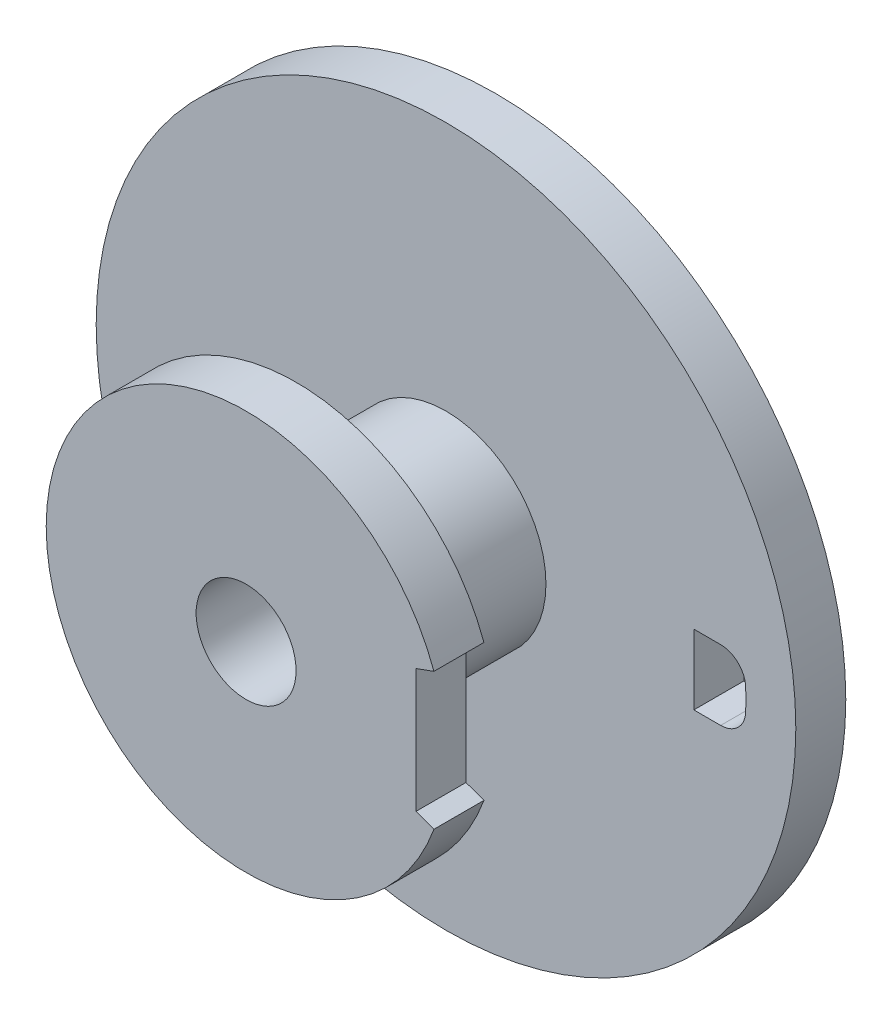
ISO-10303-21;
HEADER;
FILE_DESCRIPTION(('STEP AP214'),'2;1');
FILE_NAME('part.step','',(''),(''),'','','');
FILE_SCHEMA(('AUTOMOTIVE_DESIGN { 1 0 10303 214 1 1 1 1 }'));
ENDSEC;
DATA;
#1=APPLICATION_CONTEXT('core data for automotive mechanical design processes');
#2=APPLICATION_PROTOCOL_DEFINITION('international standard','automotive_design',2000,#1);
#3=PRODUCT_CONTEXT('',#1,'mechanical');
#4=PRODUCT('Part','Part','',(#3));
#5=PRODUCT_RELATED_PRODUCT_CATEGORY('part','',(#4));
#6=PRODUCT_DEFINITION_FORMATION('','',#4);
#7=PRODUCT_DEFINITION_CONTEXT('part definition',#1,'design');
#8=PRODUCT_DEFINITION('design','',#6,#7);
#9=PRODUCT_DEFINITION_SHAPE('','',#8);
#10=(LENGTH_UNIT() NAMED_UNIT(*) SI_UNIT(.MILLI.,.METRE.));
#11=(NAMED_UNIT(*) PLANE_ANGLE_UNIT() SI_UNIT($,.RADIAN.));
#12=(NAMED_UNIT(*) SI_UNIT($,.STERADIAN.) SOLID_ANGLE_UNIT());
#13=UNCERTAINTY_MEASURE_WITH_UNIT(LENGTH_MEASURE(1.E-05),#10,'distance_accuracy_value','');
#14=(GEOMETRIC_REPRESENTATION_CONTEXT(3) GLOBAL_UNCERTAINTY_ASSIGNED_CONTEXT((#13)) GLOBAL_UNIT_ASSIGNED_CONTEXT((#10,
#11,#12)) REPRESENTATION_CONTEXT('',''));
#15=CARTESIAN_POINT('',(0.,0.,0.));
#16=DIRECTION('',(0.,0.,1.));
#17=DIRECTION('',(1.,0.,0.));
#18=AXIS2_PLACEMENT_3D('',#15,#16,#17);
#19=CARTESIAN_POINT('',(0.,0.,-0.75));
#20=DIRECTION('',(0.,0.,1.));
#21=DIRECTION('',(1.,0.,0.));
#22=AXIS2_PLACEMENT_3D('',#19,#20,#21);
#23=CYLINDRICAL_SURFACE('',#22,0.5);
#24=CARTESIAN_POINT('',(0.,0.,-0.75));
#25=DIRECTION('',(0.,0.,-1.));
#26=DIRECTION('',(-1.,0.,0.));
#27=AXIS2_PLACEMENT_3D('',#24,#25,#26);
#28=CIRCLE('',#27,0.5);
#29=CARTESIAN_POINT('',(-0.5,0.,-0.75));
#30=VERTEX_POINT('',#29);
#31=EDGE_CURVE('E170',#30,#30,#28,.F.);
#32=ORIENTED_EDGE('',*,*,#31,.T.);
#33=EDGE_LOOP('',(#32));
#34=FACE_BOUND('',#33,.T.);
#35=CARTESIAN_POINT('',(0.,0.,0.));
#36=DIRECTION('',(0.,0.,1.));
#37=DIRECTION('',(1.,0.,0.));
#38=AXIS2_PLACEMENT_3D('',#35,#36,#37);
#39=CIRCLE('',#38,0.5);
#40=CARTESIAN_POINT('',(0.5,0.,0.));
#41=VERTEX_POINT('',#40);
#42=EDGE_CURVE('E11',#41,#41,#39,.T.);
#43=ORIENTED_EDGE('',*,*,#42,.F.);
#44=EDGE_LOOP('',(#43));
#45=FACE_BOUND('',#44,.T.);
#46=ADVANCED_FACE('F39',(#34,#45),#23,.T.);
#47=CARTESIAN_POINT('',(0.,0.,-0.75));
#48=DIRECTION('',(0.,0.,1.));
#49=DIRECTION('',(1.,0.,0.));
#50=AXIS2_PLACEMENT_3D('',#47,#48,#49);
#51=CYLINDRICAL_SURFACE('',#50,0.25);
#52=CARTESIAN_POINT('',(0.,0.,0.25));
#53=DIRECTION('',(0.,0.,1.));
#54=DIRECTION('',(1.,0.,0.));
#55=AXIS2_PLACEMENT_3D('',#52,#53,#54);
#56=CIRCLE('',#55,0.25);
#57=CARTESIAN_POINT('',(0.25,0.,0.25));
#58=VERTEX_POINT('',#57);
#59=EDGE_CURVE('E175',#58,#58,#56,.T.);
#60=ORIENTED_EDGE('',*,*,#59,.T.);
#61=EDGE_LOOP('',(#60));
#62=FACE_BOUND('',#61,.T.);
#63=CARTESIAN_POINT('',(0.,0.,-1.));
#64=DIRECTION('',(0.,0.,-1.));
#65=DIRECTION('',(-1.,0.,0.));
#66=AXIS2_PLACEMENT_3D('',#63,#64,#65);
#67=CIRCLE('',#66,0.25);
#68=CARTESIAN_POINT('',(-0.25,0.,-1.));
#69=VERTEX_POINT('',#68);
#70=EDGE_CURVE('E129',#69,#69,#67,.T.);
#71=ORIENTED_EDGE('',*,*,#70,.T.);
#72=EDGE_LOOP('',(#71));
#73=FACE_BOUND('',#72,.T.);
#74=ADVANCED_FACE('F238',(#62,#73),#51,.F.);
#75=CARTESIAN_POINT('',(0.,0.,0.25));
#76=DIRECTION('',(0.,0.,1.));
#77=DIRECTION('',(1.,0.,0.));
#78=AXIS2_PLACEMENT_3D('',#75,#76,#77);
#79=PLANE('',#78);
#80=CARTESIAN_POINT('',(0.,0.,0.25));
#81=DIRECTION('',(0.,0.,1.));
#82=DIRECTION('',(1.,0.,0.));
#83=AXIS2_PLACEMENT_3D('',#80,#81,#82);
#84=CIRCLE('',#83,1.);
#85=CARTESIAN_POINT('',(0.939692620785908,0.342020143325669,0.25));
#86=VERTEX_POINT('',#85);
#87=CARTESIAN_POINT('',(0.939692620785908,-0.342020143325669,0.25));
#88=VERTEX_POINT('',#87);
#89=EDGE_CURVE('E179',#86,#88,#84,.T.);
#90=ORIENTED_EDGE('',*,*,#89,.T.);
#91=DIRECTION('',(-0.939692620785908,0.34202014332567,0.));
#92=VECTOR('',#91,1.);
#93=CARTESIAN_POINT('',(0.85,-0.309374699126273,0.25));
#94=LINE('',#93,#92);
#95=CARTESIAN_POINT('',(0.85,-0.309374699126273,0.25));
#96=VERTEX_POINT('',#95);
#97=EDGE_CURVE('E181',#88,#96,#94,.T.);
#98=ORIENTED_EDGE('',*,*,#97,.T.);
#99=DIRECTION('',(0.,1.,0.));
#100=VECTOR('',#99,1.);
#101=CARTESIAN_POINT('',(0.85,0.309374699126273,0.25));
#102=LINE('',#101,#100);
#103=CARTESIAN_POINT('',(0.85,0.309374699126273,0.25));
#104=VERTEX_POINT('',#103);
#105=EDGE_CURVE('E184',#96,#104,#102,.T.);
#106=ORIENTED_EDGE('',*,*,#105,.T.);
#107=DIRECTION('',(0.939692620785908,0.342020143325669,0.));
#108=VECTOR('',#107,1.);
#109=CARTESIAN_POINT('',(0.85,0.309374699126273,0.25));
#110=LINE('',#109,#108);
#111=EDGE_CURVE('E186',#104,#86,#110,.T.);
#112=ORIENTED_EDGE('',*,*,#111,.T.);
#113=EDGE_LOOP('',(#90,#98,#106,#112));
#114=FACE_BOUND('',#113,.T.);
#115=ORIENTED_EDGE('',*,*,#59,.F.);
#116=EDGE_LOOP('',(#115));
#117=FACE_BOUND('',#116,.T.);
#118=ADVANCED_FACE('F225',(#114,#117),#79,.T.);
#119=CARTESIAN_POINT('',(0.,0.,0.));
#120=DIRECTION('',(0.,0.,1.));
#121=DIRECTION('',(1.,0.,0.));
#122=AXIS2_PLACEMENT_3D('',#119,#120,#121);
#123=PLANE('',#122);
#124=ORIENTED_EDGE('',*,*,#42,.T.);
#125=EDGE_LOOP('',(#124));
#126=FACE_BOUND('',#125,.T.);
#127=CARTESIAN_POINT('',(0.,0.,0.));
#128=DIRECTION('',(0.,0.,1.));
#129=DIRECTION('',(1.,0.,0.));
#130=AXIS2_PLACEMENT_3D('',#127,#128,#129);
#131=CIRCLE('',#130,1.);
#132=CARTESIAN_POINT('',(0.939692620785908,0.342020143325669,0.));
#133=VERTEX_POINT('',#132);
#134=CARTESIAN_POINT('',(0.939692620785908,-0.342020143325669,0.));
#135=VERTEX_POINT('',#134);
#136=EDGE_CURVE('E178',#133,#135,#131,.T.);
#137=ORIENTED_EDGE('',*,*,#136,.F.);
#138=DIRECTION('',(0.939692620785908,0.342020143325669,0.));
#139=VECTOR('',#138,1.);
#140=CARTESIAN_POINT('',(0.85,0.309374699126273,0.));
#141=LINE('',#140,#139);
#142=CARTESIAN_POINT('',(0.85,0.309374699126273,0.));
#143=VERTEX_POINT('',#142);
#144=EDGE_CURVE('E182',#143,#133,#141,.T.);
#145=ORIENTED_EDGE('',*,*,#144,.F.);
#146=DIRECTION('',(0.,1.,0.));
#147=VECTOR('',#146,1.);
#148=CARTESIAN_POINT('',(0.85,0.309374699126273,0.));
#149=LINE('',#148,#147);
#150=CARTESIAN_POINT('',(0.85,-0.309374699126273,0.));
#151=VERTEX_POINT('',#150);
#152=EDGE_CURVE('E192',#151,#143,#149,.T.);
#153=ORIENTED_EDGE('',*,*,#152,.F.);
#154=DIRECTION('',(-0.939692620785908,0.34202014332567,0.));
#155=VECTOR('',#154,1.);
#156=CARTESIAN_POINT('',(0.85,-0.309374699126273,0.));
#157=LINE('',#156,#155);
#158=EDGE_CURVE('E190',#135,#151,#157,.T.);
#159=ORIENTED_EDGE('',*,*,#158,.F.);
#160=EDGE_LOOP('',(#137,#145,#153,#159));
#161=FACE_BOUND('',#160,.T.);
#162=ADVANCED_FACE('F214',(#126,#161),#123,.F.);
#163=CARTESIAN_POINT('',(0.,0.,0.25));
#164=DIRECTION('',(0.,0.,-1.));
#165=DIRECTION('',(-1.,0.,0.));
#166=AXIS2_PLACEMENT_3D('',#163,#164,#165);
#167=CYLINDRICAL_SURFACE('',#166,1.);
#168=ORIENTED_EDGE('',*,*,#136,.T.);
#169=DIRECTION('',(0.,0.,-1.));
#170=VECTOR('',#169,1.);
#171=CARTESIAN_POINT('',(0.939692620785908,-0.342020143325669,0.25));
#172=LINE('',#171,#170);
#173=EDGE_CURVE('E46',#88,#135,#172,.T.);
#174=ORIENTED_EDGE('',*,*,#173,.F.);
#175=ORIENTED_EDGE('',*,*,#89,.F.);
#176=DIRECTION('',(0.,0.,-1.));
#177=VECTOR('',#176,1.);
#178=CARTESIAN_POINT('',(0.939692620785908,0.342020143325669,0.25));
#179=LINE('',#178,#177);
#180=EDGE_CURVE('E188',#86,#133,#179,.T.);
#181=ORIENTED_EDGE('',*,*,#180,.T.);
#182=EDGE_LOOP('',(#168,#174,#175,#181));
#183=FACE_BOUND('',#182,.T.);
#184=ADVANCED_FACE('F227',(#183),#167,.T.);
#185=CARTESIAN_POINT('',(0.85,-0.309374699126273,0.25));
#186=DIRECTION('',(-0.34202014332567,-0.939692620785908,0.));
#187=DIRECTION('',(0.939692620785908,-0.34202014332567,0.));
#188=AXIS2_PLACEMENT_3D('',#185,#186,#187);
#189=PLANE('',#188);
#190=ORIENTED_EDGE('',*,*,#158,.T.);
#191=DIRECTION('',(0.,0.,-1.));
#192=VECTOR('',#191,1.);
#193=CARTESIAN_POINT('',(0.85,-0.309374699126273,0.25));
#194=LINE('',#193,#192);
#195=EDGE_CURVE('E201',#96,#151,#194,.T.);
#196=ORIENTED_EDGE('',*,*,#195,.F.);
#197=ORIENTED_EDGE('',*,*,#97,.F.);
#198=ORIENTED_EDGE('',*,*,#173,.T.);
#199=EDGE_LOOP('',(#190,#196,#197,#198));
#200=FACE_BOUND('',#199,.T.);
#201=ADVANCED_FACE('F208',(#200),#189,.F.);
#202=CARTESIAN_POINT('',(0.85,0.309374699126273,0.25));
#203=DIRECTION('',(-1.,0.,0.));
#204=DIRECTION('',(0.,-1.,0.));
#205=AXIS2_PLACEMENT_3D('',#202,#203,#204);
#206=PLANE('',#205);
#207=ORIENTED_EDGE('',*,*,#152,.T.);
#208=DIRECTION('',(0.,0.,-1.));
#209=VECTOR('',#208,1.);
#210=CARTESIAN_POINT('',(0.85,0.309374699126273,0.25));
#211=LINE('',#210,#209);
#212=EDGE_CURVE('E198',#104,#143,#211,.T.);
#213=ORIENTED_EDGE('',*,*,#212,.F.);
#214=ORIENTED_EDGE('',*,*,#105,.F.);
#215=ORIENTED_EDGE('',*,*,#195,.T.);
#216=EDGE_LOOP('',(#207,#213,#214,#215));
#217=FACE_BOUND('',#216,.T.);
#218=ADVANCED_FACE('F218',(#217),#206,.F.);
#219=CARTESIAN_POINT('',(0.85,0.309374699126273,0.25));
#220=DIRECTION('',(-0.342020143325669,0.939692620785908,0.));
#221=DIRECTION('',(-0.939692620785908,-0.342020143325669,0.));
#222=AXIS2_PLACEMENT_3D('',#219,#220,#221);
#223=PLANE('',#222);
#224=ORIENTED_EDGE('',*,*,#144,.T.);
#225=ORIENTED_EDGE('',*,*,#180,.F.);
#226=ORIENTED_EDGE('',*,*,#111,.F.);
#227=ORIENTED_EDGE('',*,*,#212,.T.);
#228=EDGE_LOOP('',(#224,#225,#226,#227));
#229=FACE_BOUND('',#228,.T.);
#230=ADVANCED_FACE('F222',(#229),#223,.F.);
#231=CARTESIAN_POINT('',(0.,0.,-1.));
#232=DIRECTION('',(0.,0.,-1.));
#233=DIRECTION('',(-1.,0.,0.));
#234=AXIS2_PLACEMENT_3D('',#231,#232,#233);
#235=PLANE('',#234);
#236=DIRECTION('',(0.,1.,0.));
#237=VECTOR('',#236,1.);
#238=CARTESIAN_POINT('',(1.23975669154396,0.175,-1.));
#239=LINE('',#238,#237);
#240=CARTESIAN_POINT('',(1.23975669154396,-0.175,-1.));
#241=VERTEX_POINT('',#240);
#242=CARTESIAN_POINT('',(1.23975669154396,0.175,-1.));
#243=VERTEX_POINT('',#242);
#244=EDGE_CURVE('E53',#241,#243,#239,.T.);
#245=ORIENTED_EDGE('',*,*,#244,.F.);
#246=DIRECTION('',(-1.,0.,0.));
#247=VECTOR('',#246,1.);
#248=CARTESIAN_POINT('',(1.23975669154396,-0.175,-1.));
#249=LINE('',#248,#247);
#250=CARTESIAN_POINT('',(1.37409060836613,-0.175,-1.));
#251=VERTEX_POINT('',#250);
#252=EDGE_CURVE('E123',#251,#241,#249,.T.);
#253=ORIENTED_EDGE('',*,*,#252,.F.);
#254=CARTESIAN_POINT('',(1.37409060836613,-0.05,-1.));
#255=DIRECTION('',(0.,0.,-1.));
#256=DIRECTION('',(1.,0.,0.));
#257=AXIS2_PLACEMENT_3D('',#254,#255,#256);
#258=CIRCLE('',#257,0.125);
#259=CARTESIAN_POINT('',(1.49900793639941,-0.0545454545454545,-1.));
#260=VERTEX_POINT('',#259);
#261=EDGE_CURVE('E151',#260,#251,#258,.T.);
#262=ORIENTED_EDGE('',*,*,#261,.F.);
#263=CARTESIAN_POINT('',(0.,0.,-1.));
#264=DIRECTION('',(0.,0.,-1.));
#265=DIRECTION('',(-1.,0.,0.));
#266=AXIS2_PLACEMENT_3D('',#263,#264,#265);
#267=CIRCLE('',#266,1.5);
#268=CARTESIAN_POINT('',(1.49900793639941,0.0545454545454546,-1.));
#269=VERTEX_POINT('',#268);
#270=EDGE_CURVE('E148',#269,#260,#267,.T.);
#271=ORIENTED_EDGE('',*,*,#270,.F.);
#272=CARTESIAN_POINT('',(1.37409060836613,0.05,-1.));
#273=DIRECTION('',(0.,0.,-1.));
#274=DIRECTION('',(-1.,0.,0.));
#275=AXIS2_PLACEMENT_3D('',#272,#273,#274);
#276=CIRCLE('',#275,0.125);
#277=CARTESIAN_POINT('',(1.37409060836613,0.175,-1.));
#278=VERTEX_POINT('',#277);
#279=EDGE_CURVE('E145',#278,#269,#276,.T.);
#280=ORIENTED_EDGE('',*,*,#279,.F.);
#281=DIRECTION('',(1.,0.,0.));
#282=VECTOR('',#281,1.);
#283=CARTESIAN_POINT('',(1.37409060836613,0.175,-1.));
#284=LINE('',#283,#282);
#285=EDGE_CURVE('E138',#243,#278,#284,.T.);
#286=ORIENTED_EDGE('',*,*,#285,.F.);
#287=EDGE_LOOP('',(#245,#253,#262,#271,#280,#286));
#288=FACE_BOUND('',#287,.T.);
#289=CARTESIAN_POINT('',(0.,0.,-1.));
#290=DIRECTION('',(0.,0.,-1.));
#291=DIRECTION('',(-1.,0.,0.));
#292=AXIS2_PLACEMENT_3D('',#289,#290,#291);
#293=CIRCLE('',#292,1.75);
#294=CARTESIAN_POINT('',(-1.75,0.,-1.));
#295=VERTEX_POINT('',#294);
#296=EDGE_CURVE('E167',#295,#295,#293,.T.);
#297=ORIENTED_EDGE('',*,*,#296,.T.);
#298=EDGE_LOOP('',(#297));
#299=FACE_BOUND('',#298,.T.);
#300=ORIENTED_EDGE('',*,*,#70,.F.);
#301=EDGE_LOOP('',(#300));
#302=FACE_BOUND('',#301,.T.);
#303=ADVANCED_FACE('F250',(#288,#299,#302),#235,.T.);
#304=CARTESIAN_POINT('',(0.,0.,-0.75));
#305=DIRECTION('',(0.,0.,-1.));
#306=DIRECTION('',(-1.,0.,0.));
#307=AXIS2_PLACEMENT_3D('',#304,#305,#306);
#308=PLANE('',#307);
#309=DIRECTION('',(1.,0.,0.));
#310=VECTOR('',#309,1.);
#311=CARTESIAN_POINT('',(1.23975669154396,-0.175,-0.75));
#312=LINE('',#311,#310);
#313=CARTESIAN_POINT('',(1.23975669154396,-0.175,-0.75));
#314=VERTEX_POINT('',#313);
#315=CARTESIAN_POINT('',(1.37409060836613,-0.175,-0.75));
#316=VERTEX_POINT('',#315);
#317=EDGE_CURVE('E136',#314,#316,#312,.T.);
#318=ORIENTED_EDGE('',*,*,#317,.F.);
#319=DIRECTION('',(0.,-1.,0.));
#320=VECTOR('',#319,1.);
#321=CARTESIAN_POINT('',(1.23975669154396,0.175,-0.75));
#322=LINE('',#321,#320);
#323=CARTESIAN_POINT('',(1.23975669154396,0.175,-0.75));
#324=VERTEX_POINT('',#323);
#325=EDGE_CURVE('E117',#324,#314,#322,.T.);
#326=ORIENTED_EDGE('',*,*,#325,.F.);
#327=DIRECTION('',(-1.,0.,0.));
#328=VECTOR('',#327,1.);
#329=CARTESIAN_POINT('',(1.37409060836613,0.175,-0.75));
#330=LINE('',#329,#328);
#331=CARTESIAN_POINT('',(1.37409060836613,0.175,-0.75));
#332=VERTEX_POINT('',#331);
#333=EDGE_CURVE('E126',#332,#324,#330,.T.);
#334=ORIENTED_EDGE('',*,*,#333,.F.);
#335=CARTESIAN_POINT('',(1.37409060836613,0.05,-0.75));
#336=DIRECTION('',(0.,0.,-1.));
#337=DIRECTION('',(-1.,0.,0.));
#338=AXIS2_PLACEMENT_3D('',#335,#336,#337);
#339=CIRCLE('',#338,0.125);
#340=CARTESIAN_POINT('',(1.49900793639941,0.0545454545454546,-0.75));
#341=VERTEX_POINT('',#340);
#342=EDGE_CURVE('E61',#341,#332,#339,.F.);
#343=ORIENTED_EDGE('',*,*,#342,.F.);
#344=CARTESIAN_POINT('',(0.,0.,-0.75));
#345=DIRECTION('',(0.,0.,-1.));
#346=DIRECTION('',(-1.,0.,0.));
#347=AXIS2_PLACEMENT_3D('',#344,#345,#346);
#348=CIRCLE('',#347,1.5);
#349=CARTESIAN_POINT('',(1.49900793639941,-0.0545454545454545,-0.75));
#350=VERTEX_POINT('',#349);
#351=EDGE_CURVE('E411',#350,#341,#348,.F.);
#352=ORIENTED_EDGE('',*,*,#351,.F.);
#353=CARTESIAN_POINT('',(1.37409060836613,-0.05,-0.75));
#354=DIRECTION('',(0.,0.,-1.));
#355=DIRECTION('',(-1.,0.,0.));
#356=AXIS2_PLACEMENT_3D('',#353,#354,#355);
#357=CIRCLE('',#356,0.125);
#358=EDGE_CURVE('E140',#316,#350,#357,.F.);
#359=ORIENTED_EDGE('',*,*,#358,.F.);
#360=EDGE_LOOP('',(#318,#326,#334,#343,#352,#359));
#361=FACE_BOUND('',#360,.T.);
#362=ORIENTED_EDGE('',*,*,#31,.F.);
#363=EDGE_LOOP('',(#362));
#364=FACE_BOUND('',#363,.T.);
#365=CARTESIAN_POINT('',(0.,0.,-0.75));
#366=DIRECTION('',(0.,0.,-1.));
#367=DIRECTION('',(-1.,0.,0.));
#368=AXIS2_PLACEMENT_3D('',#365,#366,#367);
#369=CIRCLE('',#368,1.75);
#370=CARTESIAN_POINT('',(-1.75,0.,-0.75));
#371=VERTEX_POINT('',#370);
#372=EDGE_CURVE('E166',#371,#371,#369,.T.);
#373=ORIENTED_EDGE('',*,*,#372,.F.);
#374=EDGE_LOOP('',(#373));
#375=FACE_BOUND('',#374,.T.);
#376=ADVANCED_FACE('F132',(#361,#364,#375),#308,.F.);
#377=CARTESIAN_POINT('',(0.,0.,-1.));
#378=DIRECTION('',(0.,0.,1.));
#379=DIRECTION('',(1.,0.,0.));
#380=AXIS2_PLACEMENT_3D('',#377,#378,#379);
#381=CYLINDRICAL_SURFACE('',#380,1.75);
#382=ORIENTED_EDGE('',*,*,#296,.F.);
#383=EDGE_LOOP('',(#382));
#384=FACE_BOUND('',#383,.T.);
#385=ORIENTED_EDGE('',*,*,#372,.T.);
#386=EDGE_LOOP('',(#385));
#387=FACE_BOUND('',#386,.T.);
#388=ADVANCED_FACE('F249',(#384,#387),#381,.T.);
#389=CARTESIAN_POINT('',(1.23975669154396,0.175,0.251));
#390=DIRECTION('',(-1.,0.,0.));
#391=DIRECTION('',(0.,-1.,0.));
#392=AXIS2_PLACEMENT_3D('',#389,#390,#391);
#393=PLANE('',#392);
#394=ORIENTED_EDGE('',*,*,#325,.T.);
#395=DIRECTION('',(0.,0.,-1.));
#396=VECTOR('',#395,1.);
#397=CARTESIAN_POINT('',(1.23975669154396,-0.175,0.251));
#398=LINE('',#397,#396);
#399=EDGE_CURVE('E130',#314,#241,#398,.T.);
#400=ORIENTED_EDGE('',*,*,#399,.T.);
#401=ORIENTED_EDGE('',*,*,#244,.T.);
#402=DIRECTION('',(0.,0.,-1.));
#403=VECTOR('',#402,1.);
#404=CARTESIAN_POINT('',(1.23975669154396,0.175,0.251));
#405=LINE('',#404,#403);
#406=EDGE_CURVE('E113',#324,#243,#405,.T.);
#407=ORIENTED_EDGE('',*,*,#406,.F.);
#408=EDGE_LOOP('',(#394,#400,#401,#407));
#409=FACE_BOUND('',#408,.T.);
#410=ADVANCED_FACE('F115',(#409),#393,.F.);
#411=CARTESIAN_POINT('',(1.23975669154396,-0.175,0.251));
#412=DIRECTION('',(0.,-1.,0.));
#413=DIRECTION('',(1.,0.,0.));
#414=AXIS2_PLACEMENT_3D('',#411,#412,#413);
#415=PLANE('',#414);
#416=ORIENTED_EDGE('',*,*,#317,.T.);
#417=DIRECTION('',(0.,0.,-1.));
#418=VECTOR('',#417,1.);
#419=CARTESIAN_POINT('',(1.37409060836613,-0.175,0.251));
#420=LINE('',#419,#418);
#421=EDGE_CURVE('E157',#316,#251,#420,.T.);
#422=ORIENTED_EDGE('',*,*,#421,.T.);
#423=ORIENTED_EDGE('',*,*,#252,.T.);
#424=ORIENTED_EDGE('',*,*,#399,.F.);
#425=EDGE_LOOP('',(#416,#422,#423,#424));
#426=FACE_BOUND('',#425,.T.);
#427=ADVANCED_FACE('F260',(#426),#415,.F.);
#428=CARTESIAN_POINT('',(1.37409060836613,-0.05,0.251));
#429=DIRECTION('',(0.,0.,-1.));
#430=DIRECTION('',(-1.,0.,0.));
#431=AXIS2_PLACEMENT_3D('',#428,#429,#430);
#432=CYLINDRICAL_SURFACE('',#431,0.125);
#433=ORIENTED_EDGE('',*,*,#358,.T.);
#434=DIRECTION('',(0.,0.,-1.));
#435=VECTOR('',#434,1.);
#436=CARTESIAN_POINT('',(1.49900793639941,-0.0545454545454545,0.251));
#437=LINE('',#436,#435);
#438=EDGE_CURVE('E159',#350,#260,#437,.T.);
#439=ORIENTED_EDGE('',*,*,#438,.T.);
#440=ORIENTED_EDGE('',*,*,#261,.T.);
#441=ORIENTED_EDGE('',*,*,#421,.F.);
#442=EDGE_LOOP('',(#433,#439,#440,#441));
#443=FACE_BOUND('',#442,.T.);
#444=ADVANCED_FACE('F368',(#443),#432,.F.);
#445=CARTESIAN_POINT('',(0.,0.,0.251));
#446=DIRECTION('',(0.,0.,-1.));
#447=DIRECTION('',(-1.,0.,0.));
#448=AXIS2_PLACEMENT_3D('',#445,#446,#447);
#449=CYLINDRICAL_SURFACE('',#448,1.5);
#450=ORIENTED_EDGE('',*,*,#351,.T.);
#451=DIRECTION('',(0.,0.,-1.));
#452=VECTOR('',#451,1.);
#453=CARTESIAN_POINT('',(1.49900793639941,0.0545454545454546,0.251));
#454=LINE('',#453,#452);
#455=EDGE_CURVE('E161',#341,#269,#454,.T.);
#456=ORIENTED_EDGE('',*,*,#455,.T.);
#457=ORIENTED_EDGE('',*,*,#270,.T.);
#458=ORIENTED_EDGE('',*,*,#438,.F.);
#459=EDGE_LOOP('',(#450,#456,#457,#458));
#460=FACE_BOUND('',#459,.T.);
#461=ADVANCED_FACE('F377',(#460),#449,.F.);
#462=CARTESIAN_POINT('',(1.37409060836613,0.05,0.251));
#463=DIRECTION('',(0.,0.,-1.));
#464=DIRECTION('',(-1.,0.,0.));
#465=AXIS2_PLACEMENT_3D('',#462,#463,#464);
#466=CYLINDRICAL_SURFACE('',#465,0.125);
#467=ORIENTED_EDGE('',*,*,#342,.T.);
#468=DIRECTION('',(0.,0.,-1.));
#469=VECTOR('',#468,1.);
#470=CARTESIAN_POINT('',(1.37409060836613,0.175,0.251));
#471=LINE('',#470,#469);
#472=EDGE_CURVE('E122',#332,#278,#471,.T.);
#473=ORIENTED_EDGE('',*,*,#472,.T.);
#474=ORIENTED_EDGE('',*,*,#279,.T.);
#475=ORIENTED_EDGE('',*,*,#455,.F.);
#476=EDGE_LOOP('',(#467,#473,#474,#475));
#477=FACE_BOUND('',#476,.T.);
#478=ADVANCED_FACE('F386',(#477),#466,.F.);
#479=CARTESIAN_POINT('',(1.37409060836613,0.175,0.251));
#480=DIRECTION('',(0.,1.,0.));
#481=DIRECTION('',(-1.,0.,0.));
#482=AXIS2_PLACEMENT_3D('',#479,#480,#481);
#483=PLANE('',#482);
#484=ORIENTED_EDGE('',*,*,#333,.T.);
#485=ORIENTED_EDGE('',*,*,#406,.T.);
#486=ORIENTED_EDGE('',*,*,#285,.T.);
#487=ORIENTED_EDGE('',*,*,#472,.F.);
#488=EDGE_LOOP('',(#484,#485,#486,#487));
#489=FACE_BOUND('',#488,.T.);
#490=ADVANCED_FACE('F127',(#489),#483,.F.);
#491=CLOSED_SHELL('',(#46,#74,#118,#162,#184,#201,#218,#230,#303,#376,#388,#410,#427,#444,#461,
#478,#490));
#492=MANIFOLD_SOLID_BREP('B2',#491);
#493=ADVANCED_BREP_SHAPE_REPRESENTATION('',(#18,#492),#14);
#494=SHAPE_DEFINITION_REPRESENTATION(#9,#493);
ENDSEC;
END-ISO-10303-21;
